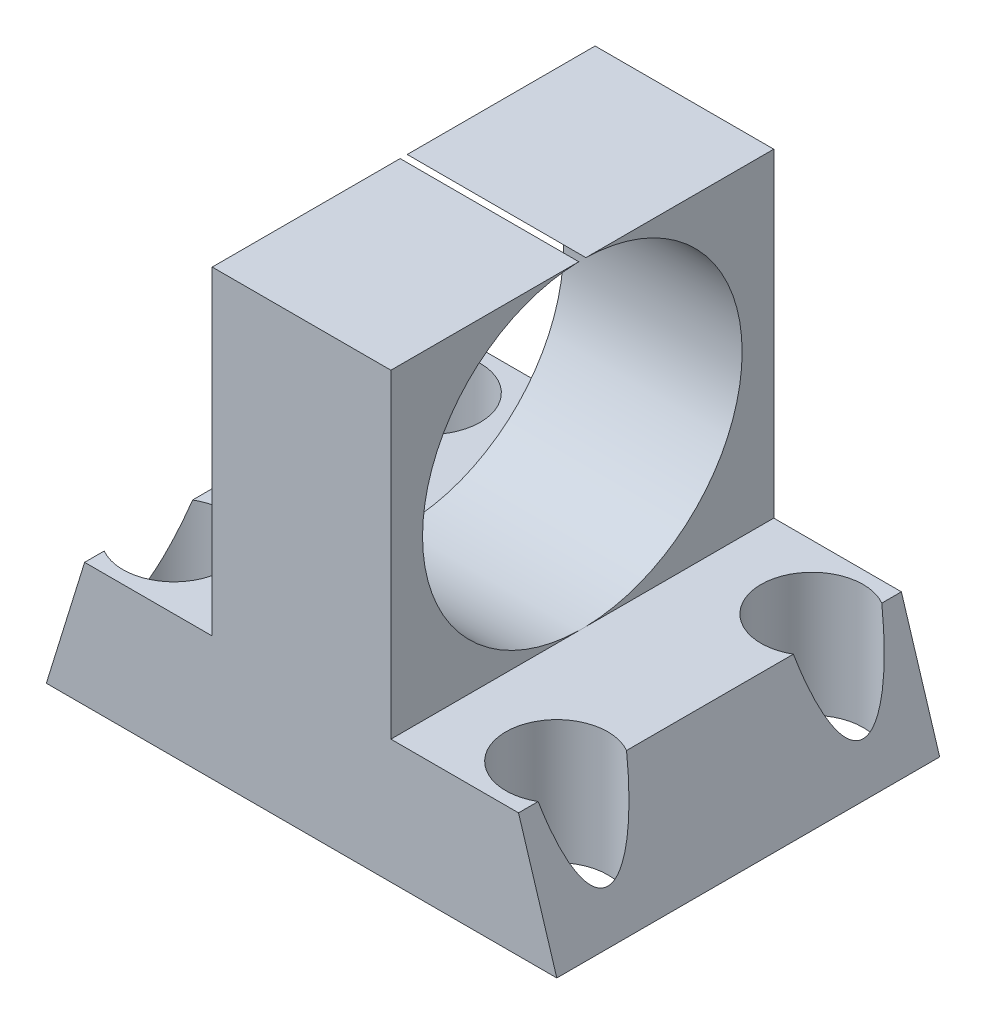
ISO-10303-21;
HEADER;
FILE_DESCRIPTION(('STEP AP214'),'2;1');
FILE_NAME('part.step','',(''),(''),'','','');
FILE_SCHEMA(('AUTOMOTIVE_DESIGN { 1 0 10303 214 1 1 1 1 }'));
ENDSEC;
DATA;
#1=APPLICATION_CONTEXT('core data for automotive mechanical design processes');
#2=APPLICATION_PROTOCOL_DEFINITION('international standard','automotive_design',2000,#1);
#3=PRODUCT_CONTEXT('',#1,'mechanical');
#4=PRODUCT('Part','Part','',(#3));
#5=PRODUCT_RELATED_PRODUCT_CATEGORY('part','',(#4));
#6=PRODUCT_DEFINITION_FORMATION('','',#4);
#7=PRODUCT_DEFINITION_CONTEXT('part definition',#1,'design');
#8=PRODUCT_DEFINITION('design','',#6,#7);
#9=PRODUCT_DEFINITION_SHAPE('','',#8);
#10=(LENGTH_UNIT() NAMED_UNIT(*) SI_UNIT(.MILLI.,.METRE.));
#11=(NAMED_UNIT(*) PLANE_ANGLE_UNIT() SI_UNIT($,.RADIAN.));
#12=(NAMED_UNIT(*) SI_UNIT($,.STERADIAN.) SOLID_ANGLE_UNIT());
#13=UNCERTAINTY_MEASURE_WITH_UNIT(LENGTH_MEASURE(1.E-05),#10,'distance_accuracy_value','');
#14=(GEOMETRIC_REPRESENTATION_CONTEXT(3) GLOBAL_UNCERTAINTY_ASSIGNED_CONTEXT((#13)) GLOBAL_UNIT_ASSIGNED_CONTEXT((#10,
#11,#12)) REPRESENTATION_CONTEXT('',''));
#15=CARTESIAN_POINT('',(0.,0.,0.));
#16=DIRECTION('',(0.,0.,1.));
#17=DIRECTION('',(1.,0.,0.));
#18=AXIS2_PLACEMENT_3D('',#15,#16,#17);
#19=CARTESIAN_POINT('',(-8.86861313868613,0.,15.));
#20=DIRECTION('',(0.955421064212183,-0.295246659692638,0.));
#21=DIRECTION('',(0.295246659692638,0.955421064212183,0.));
#22=AXIS2_PLACEMENT_3D('',#19,#20,#21);
#23=PLANE('',#22);
#24=CARTESIAN_POINT('',(-7.86861313868613,3.23600973236007,2.5));
#25=DIRECTION('',(0.955421064212183,-0.295246659692638,0.));
#26=DIRECTION('',(-0.295246659692638,-0.955421064212183,0.));
#27=AXIS2_PLACEMENT_3D('',#24,#25,#26);
#28=ELLIPSE('',#27,6.77399704397019,2.);
#29=CARTESIAN_POINT('',(-8.86861313868613,0.,0.767949192431118));
#30=VERTEX_POINT('',#29);
#31=CARTESIAN_POINT('',(-8.86861313868613,0.,4.23205080756888));
#32=VERTEX_POINT('',#31);
#33=EDGE_CURVE('E299',#30,#32,#28,.F.);
#34=ORIENTED_EDGE('',*,*,#33,.F.);
#35=DIRECTION('',(0.,0.,-1.));
#36=VECTOR('',#35,1.);
#37=CARTESIAN_POINT('',(-8.86861313868613,0.,15.));
#38=LINE('',#37,#36);
#39=CARTESIAN_POINT('',(-8.86861313868613,0.,0.));
#40=VERTEX_POINT('',#39);
#41=EDGE_CURVE('E41',#30,#40,#38,.T.);
#42=ORIENTED_EDGE('',*,*,#41,.T.);
#43=DIRECTION('',(-0.295246659692638,-0.955421064212183,0.));
#44=VECTOR('',#43,1.);
#45=CARTESIAN_POINT('',(-8.86861313868613,0.,0.));
#46=LINE('',#45,#44);
#47=CARTESIAN_POINT('',(-10.3686131386861,-4.85401459854015,0.));
#48=VERTEX_POINT('',#47);
#49=EDGE_CURVE('E350',#40,#48,#46,.T.);
#50=ORIENTED_EDGE('',*,*,#49,.T.);
#51=DIRECTION('',(0.,0.,-1.));
#52=VECTOR('',#51,1.);
#53=CARTESIAN_POINT('',(-10.3686131386861,-4.85401459854015,15.));
#54=LINE('',#53,#52);
#55=CARTESIAN_POINT('',(-10.3686131386861,-4.85401459854015,15.));
#56=VERTEX_POINT('',#55);
#57=EDGE_CURVE('E262',#56,#48,#54,.T.);
#58=ORIENTED_EDGE('',*,*,#57,.F.);
#59=DIRECTION('',(-0.295246659692638,-0.955421064212183,0.));
#60=VECTOR('',#59,1.);
#61=CARTESIAN_POINT('',(-8.86861313868613,0.,15.));
#62=LINE('',#61,#60);
#63=CARTESIAN_POINT('',(-8.86861313868613,0.,15.));
#64=VERTEX_POINT('',#63);
#65=EDGE_CURVE('E213',#64,#56,#62,.T.);
#66=ORIENTED_EDGE('',*,*,#65,.F.);
#67=CARTESIAN_POINT('',(-8.86861313868613,0.,14.2320508075689));
#68=VERTEX_POINT('',#67);
#69=EDGE_CURVE('E171',#64,#68,#38,.T.);
#70=ORIENTED_EDGE('',*,*,#69,.T.);
#71=CARTESIAN_POINT('',(-7.86861313868613,3.23600973236007,12.5));
#72=DIRECTION('',(0.955421064212183,-0.295246659692638,0.));
#73=DIRECTION('',(-0.295246659692638,-0.955421064212183,0.));
#74=AXIS2_PLACEMENT_3D('',#71,#72,#73);
#75=ELLIPSE('',#74,6.7739970439702,2.);
#76=CARTESIAN_POINT('',(-8.86861313868613,0.,10.7679491924311));
#77=VERTEX_POINT('',#76);
#78=EDGE_CURVE('E159',#68,#77,#75,.T.);
#79=ORIENTED_EDGE('',*,*,#78,.T.);
#80=CARTESIAN_POINT('',(-8.86861313868613,0.,7.63905587694962));
#81=VERTEX_POINT('',#80);
#82=EDGE_CURVE('E168',#77,#81,#38,.T.);
#83=ORIENTED_EDGE('',*,*,#82,.T.);
#84=CARTESIAN_POINT('',(-8.86861313868613,0.,7.63905587694962));
#85=CARTESIAN_POINT('',(-8.86956781317178,-0.00308933592682558,7.5));
#86=CARTESIAN_POINT('',(-8.86861313868613,0.,7.36094412305038));
#87=B_SPLINE_CURVE_WITH_KNOTS('',2,(#84,#85,#86),.UNSPECIFIED.,.F.,.F.,(3,3),(0.,1.),.UNSPECIFIED.);
#88=CARTESIAN_POINT('',(-8.86861313868613,0.,7.36094412305025));
#89=VERTEX_POINT('',#88);
#90=EDGE_CURVE('E208',#81,#89,#87,.T.);
#91=ORIENTED_EDGE('',*,*,#90,.T.);
#92=EDGE_CURVE('E179',#89,#32,#38,.T.);
#93=ORIENTED_EDGE('',*,*,#92,.T.);
#94=EDGE_LOOP('',(#34,#42,#50,#58,#66,#70,#79,#83,#91,#93));
#95=FACE_BOUND('',#94,.T.);
#96=ADVANCED_FACE('F37',(#95),#23,.F.);
#97=CARTESIAN_POINT('',(-10.3686131386861,-4.85401459854015,15.));
#98=DIRECTION('',(0.,1.,0.));
#99=DIRECTION('',(0.,0.,1.));
#100=AXIS2_PLACEMENT_3D('',#97,#98,#99);
#101=PLANE('',#100);
#102=CARTESIAN_POINT('',(7.13138686131387,-4.85401459854015,2.5));
#103=DIRECTION('',(0.,-1.,0.));
#104=DIRECTION('',(0.,0.,-1.));
#105=AXIS2_PLACEMENT_3D('',#102,#103,#104);
#106=CIRCLE('',#105,2.);
#107=CARTESIAN_POINT('',(7.13138686131387,-4.85401459854015,0.499999999999999));
#108=VERTEX_POINT('',#107);
#109=EDGE_CURVE('E309',#108,#108,#106,.T.);
#110=ORIENTED_EDGE('',*,*,#109,.F.);
#111=EDGE_LOOP('',(#110));
#112=FACE_BOUND('',#111,.T.);
#113=CARTESIAN_POINT('',(-7.86861313868613,-4.85401459854015,12.5));
#114=DIRECTION('',(0.,-1.,0.));
#115=DIRECTION('',(0.,0.,-1.));
#116=AXIS2_PLACEMENT_3D('',#113,#114,#115);
#117=CIRCLE('',#116,2.);
#118=CARTESIAN_POINT('',(-7.86861313868613,-4.85401459854015,10.5));
#119=VERTEX_POINT('',#118);
#120=EDGE_CURVE('E173',#119,#119,#117,.T.);
#121=ORIENTED_EDGE('',*,*,#120,.F.);
#122=EDGE_LOOP('',(#121));
#123=FACE_BOUND('',#122,.T.);
#124=DIRECTION('',(1.,0.,0.));
#125=VECTOR('',#124,1.);
#126=CARTESIAN_POINT('',(-10.3686131386861,-4.85401459854015,0.));
#127=LINE('',#126,#125);
#128=CARTESIAN_POINT('',(9.63138686131387,-4.85401459854015,0.));
#129=VERTEX_POINT('',#128);
#130=EDGE_CURVE('E377',#48,#129,#127,.T.);
#131=ORIENTED_EDGE('',*,*,#130,.T.);
#132=DIRECTION('',(0.,0.,-1.));
#133=VECTOR('',#132,1.);
#134=CARTESIAN_POINT('',(9.63138686131387,-4.85401459854015,15.));
#135=LINE('',#134,#133);
#136=CARTESIAN_POINT('',(9.63138686131387,-4.85401459854015,15.));
#137=VERTEX_POINT('',#136);
#138=EDGE_CURVE('E337',#137,#129,#135,.T.);
#139=ORIENTED_EDGE('',*,*,#138,.F.);
#140=DIRECTION('',(1.,0.,0.));
#141=VECTOR('',#140,1.);
#142=CARTESIAN_POINT('',(-10.3686131386861,-4.85401459854015,15.));
#143=LINE('',#142,#141);
#144=EDGE_CURVE('E406',#56,#137,#143,.T.);
#145=ORIENTED_EDGE('',*,*,#144,.F.);
#146=ORIENTED_EDGE('',*,*,#57,.T.);
#147=EDGE_LOOP('',(#131,#139,#145,#146));
#148=FACE_BOUND('',#147,.T.);
#149=CARTESIAN_POINT('',(7.13138686131387,-4.85401459854015,12.5));
#150=DIRECTION('',(0.,-1.,0.));
#151=DIRECTION('',(0.,0.,-1.));
#152=AXIS2_PLACEMENT_3D('',#149,#150,#151);
#153=CIRCLE('',#152,2.);
#154=CARTESIAN_POINT('',(7.13138686131387,-4.85401459854015,10.5));
#155=VERTEX_POINT('',#154);
#156=EDGE_CURVE('E305',#155,#155,#153,.F.);
#157=ORIENTED_EDGE('',*,*,#156,.T.);
#158=EDGE_LOOP('',(#157));
#159=FACE_BOUND('',#158,.T.);
#160=CARTESIAN_POINT('',(-7.86861313868613,-4.85401459854015,2.5));
#161=DIRECTION('',(0.,-1.,0.));
#162=DIRECTION('',(0.,0.,-1.));
#163=AXIS2_PLACEMENT_3D('',#160,#161,#162);
#164=CIRCLE('',#163,2.);
#165=CARTESIAN_POINT('',(-7.86861313868613,-4.85401459854015,0.499999999999998));
#166=VERTEX_POINT('',#165);
#167=EDGE_CURVE('E306',#166,#166,#164,.F.);
#168=ORIENTED_EDGE('',*,*,#167,.T.);
#169=EDGE_LOOP('',(#168));
#170=FACE_BOUND('',#169,.T.);
#171=ADVANCED_FACE('F315',(#112,#123,#148,#159,#170),#101,.F.);
#172=CARTESIAN_POINT('',(9.63138686131387,-4.85401459854015,15.));
#173=DIRECTION('',(-0.955421064212183,-0.295246659692637,0.));
#174=DIRECTION('',(0.295246659692637,-0.955421064212183,0.));
#175=AXIS2_PLACEMENT_3D('',#172,#173,#174);
#176=PLANE('',#175);
#177=DIRECTION('',(0.,0.,-1.));
#178=VECTOR('',#177,1.);
#179=CARTESIAN_POINT('',(8.13138686131387,0.,15.));
#180=LINE('',#179,#178);
#181=CARTESIAN_POINT('',(8.13138686131387,0.,0.76794919243112));
#182=VERTEX_POINT('',#181);
#183=CARTESIAN_POINT('',(8.13138686131387,0.,0.));
#184=VERTEX_POINT('',#183);
#185=EDGE_CURVE('E336',#182,#184,#180,.T.);
#186=ORIENTED_EDGE('',*,*,#185,.F.);
#187=CARTESIAN_POINT('',(7.13138686131387,3.23600973236008,2.5));
#188=DIRECTION('',(-0.955421064212183,-0.295246659692637,0.));
#189=DIRECTION('',(0.295246659692637,-0.955421064212183,0.));
#190=AXIS2_PLACEMENT_3D('',#187,#188,#189);
#191=ELLIPSE('',#190,6.7739970439702,2.);
#192=CARTESIAN_POINT('',(8.13138686131387,0.,4.23205080756888));
#193=VERTEX_POINT('',#192);
#194=EDGE_CURVE('E60',#182,#193,#191,.T.);
#195=ORIENTED_EDGE('',*,*,#194,.T.);
#196=CARTESIAN_POINT('',(8.13138686131387,0.,10.7679491924311));
#197=VERTEX_POINT('',#196);
#198=EDGE_CURVE('E332',#197,#193,#180,.T.);
#199=ORIENTED_EDGE('',*,*,#198,.F.);
#200=CARTESIAN_POINT('',(7.13138686131387,3.23600973236008,12.5));
#201=DIRECTION('',(-0.955421064212183,-0.295246659692637,0.));
#202=DIRECTION('',(0.295246659692637,-0.955421064212183,0.));
#203=AXIS2_PLACEMENT_3D('',#200,#201,#202);
#204=ELLIPSE('',#203,6.7739970439702,2.);
#205=CARTESIAN_POINT('',(8.13138686131387,0.,14.2320508075689));
#206=VERTEX_POINT('',#205);
#207=EDGE_CURVE('E172',#206,#197,#204,.F.);
#208=ORIENTED_EDGE('',*,*,#207,.F.);
#209=CARTESIAN_POINT('',(8.13138686131387,0.,15.));
#210=VERTEX_POINT('',#209);
#211=EDGE_CURVE('E279',#210,#206,#180,.T.);
#212=ORIENTED_EDGE('',*,*,#211,.F.);
#213=DIRECTION('',(-0.295246659692637,0.955421064212183,0.));
#214=VECTOR('',#213,1.);
#215=CARTESIAN_POINT('',(9.63138686131387,-4.85401459854015,15.));
#216=LINE('',#215,#214);
#217=EDGE_CURVE('E388',#137,#210,#216,.T.);
#218=ORIENTED_EDGE('',*,*,#217,.F.);
#219=ORIENTED_EDGE('',*,*,#138,.T.);
#220=DIRECTION('',(-0.295246659692637,0.955421064212183,0.));
#221=VECTOR('',#220,1.);
#222=CARTESIAN_POINT('',(9.63138686131387,-4.85401459854015,0.));
#223=LINE('',#222,#221);
#224=EDGE_CURVE('E385',#129,#184,#223,.T.);
#225=ORIENTED_EDGE('',*,*,#224,.T.);
#226=EDGE_LOOP('',(#186,#195,#199,#208,#212,#218,#219,#225));
#227=FACE_BOUND('',#226,.T.);
#228=ADVANCED_FACE('F335',(#227),#176,.F.);
#229=CARTESIAN_POINT('',(8.13138686131387,0.,15.));
#230=DIRECTION('',(0.,-1.,0.));
#231=DIRECTION('',(1.,0.,0.));
#232=AXIS2_PLACEMENT_3D('',#229,#230,#231);
#233=PLANE('',#232);
#234=ORIENTED_EDGE('',*,*,#198,.T.);
#235=CARTESIAN_POINT('',(7.13138686131387,0.,2.5));
#236=DIRECTION('',(0.,-1.,0.));
#237=DIRECTION('',(1.,0.,0.));
#238=AXIS2_PLACEMENT_3D('',#235,#236,#237);
#239=CIRCLE('',#238,2.);
#240=EDGE_CURVE('E11',#193,#182,#239,.T.);
#241=ORIENTED_EDGE('',*,*,#240,.T.);
#242=ORIENTED_EDGE('',*,*,#185,.T.);
#243=DIRECTION('',(-1.,0.,0.));
#244=VECTOR('',#243,1.);
#245=CARTESIAN_POINT('',(8.13138686131387,0.,0.));
#246=LINE('',#245,#244);
#247=CARTESIAN_POINT('',(3.13138686131387,0.,0.));
#248=VERTEX_POINT('',#247);
#249=EDGE_CURVE('E390',#184,#248,#246,.T.);
#250=ORIENTED_EDGE('',*,*,#249,.T.);
#251=DIRECTION('',(0.,0.,-1.));
#252=VECTOR('',#251,1.);
#253=CARTESIAN_POINT('',(3.13138686131387,0.,15.));
#254=LINE('',#253,#252);
#255=CARTESIAN_POINT('',(3.13138686131387,0.,7.36094412305018));
#256=VERTEX_POINT('',#255);
#257=EDGE_CURVE('E270',#256,#248,#254,.T.);
#258=ORIENTED_EDGE('',*,*,#257,.F.);
#259=CARTESIAN_POINT('',(3.13138686131387,6.25912408759124,7.5));
#260=DIRECTION('',(1.,0.,0.));
#261=DIRECTION('',(0.,-0.999753304716146,0.022211026746761));
#262=AXIS2_PLACEMENT_3D('',#259,#260,#261);
#263=CIRCLE('',#262,6.260668565);
#264=CARTESIAN_POINT('',(3.13138686131387,0.,7.63905587694982));
#265=VERTEX_POINT('',#264);
#266=EDGE_CURVE('E240',#265,#256,#263,.T.);
#267=ORIENTED_EDGE('',*,*,#266,.F.);
#268=CARTESIAN_POINT('',(3.13138686131387,0.,15.));
#269=VERTEX_POINT('',#268);
#270=EDGE_CURVE('E282',#269,#265,#254,.T.);
#271=ORIENTED_EDGE('',*,*,#270,.F.);
#272=DIRECTION('',(-1.,0.,0.));
#273=VECTOR('',#272,1.);
#274=CARTESIAN_POINT('',(8.13138686131387,0.,15.));
#275=LINE('',#274,#273);
#276=EDGE_CURVE('E348',#210,#269,#275,.T.);
#277=ORIENTED_EDGE('',*,*,#276,.F.);
#278=ORIENTED_EDGE('',*,*,#211,.T.);
#279=CARTESIAN_POINT('',(7.13138686131387,0.,12.5));
#280=DIRECTION('',(0.,-1.,0.));
#281=DIRECTION('',(1.,0.,0.));
#282=AXIS2_PLACEMENT_3D('',#279,#280,#281);
#283=CIRCLE('',#282,2.);
#284=EDGE_CURVE('E47',#197,#206,#283,.F.);
#285=ORIENTED_EDGE('',*,*,#284,.F.);
#286=EDGE_LOOP('',(#234,#241,#242,#250,#258,#267,#271,#277,#278,#285));
#287=FACE_BOUND('',#286,.T.);
#288=ADVANCED_FACE('F331',(#287),#233,.F.);
#289=CARTESIAN_POINT('',(3.13138686131387,0.,15.));
#290=DIRECTION('',(-1.,0.,0.));
#291=DIRECTION('',(0.,-1.,0.));
#292=AXIS2_PLACEMENT_3D('',#289,#290,#291);
#293=PLANE('',#292);
#294=ORIENTED_EDGE('',*,*,#270,.T.);
#295=CARTESIAN_POINT('',(3.13138686131387,6.25912408759124,7.5));
#296=DIRECTION('',(1.,0.,0.));
#297=DIRECTION('',(0.,1.,0.));
#298=AXIS2_PLACEMENT_3D('',#295,#296,#297);
#299=CIRCLE('',#298,6.260668565);
#300=CARTESIAN_POINT('',(3.13138686131387,12.5182481751825,7.63905587694975));
#301=VERTEX_POINT('',#300);
#302=EDGE_CURVE('E242',#301,#265,#299,.T.);
#303=ORIENTED_EDGE('',*,*,#302,.F.);
#304=DIRECTION('',(0.,0.,-1.));
#305=VECTOR('',#304,1.);
#306=CARTESIAN_POINT('',(3.13138686131387,12.5182481751825,15.));
#307=LINE('',#306,#305);
#308=CARTESIAN_POINT('',(3.13138686131387,12.5182481751825,15.));
#309=VERTEX_POINT('',#308);
#310=EDGE_CURVE('E266',#309,#301,#307,.T.);
#311=ORIENTED_EDGE('',*,*,#310,.F.);
#312=DIRECTION('',(0.,1.,0.));
#313=VECTOR('',#312,1.);
#314=CARTESIAN_POINT('',(3.13138686131387,0.,15.));
#315=LINE('',#314,#313);
#316=EDGE_CURVE('E347',#269,#309,#315,.T.);
#317=ORIENTED_EDGE('',*,*,#316,.F.);
#318=EDGE_LOOP('',(#294,#303,#311,#317));
#319=FACE_BOUND('',#318,.T.);
#320=ADVANCED_FACE('F345',(#319),#293,.F.);
#321=CARTESIAN_POINT('',(3.13138686131387,12.5182481751825,15.));
#322=DIRECTION('',(0.,-1.,0.));
#323=DIRECTION('',(0.,0.,-1.));
#324=AXIS2_PLACEMENT_3D('',#321,#322,#323);
#325=PLANE('',#324);
#326=DIRECTION('',(0.,0.,-1.));
#327=VECTOR('',#326,1.);
#328=CARTESIAN_POINT('',(-3.86861313868613,12.5182481751825,15.));
#329=LINE('',#328,#327);
#330=CARTESIAN_POINT('',(-3.86861313868613,12.5182481751825,7.3609441230502));
#331=VERTEX_POINT('',#330);
#332=CARTESIAN_POINT('',(-3.86861313868613,12.5182481751825,0.));
#333=VERTEX_POINT('',#332);
#334=EDGE_CURVE('E421',#331,#333,#329,.T.);
#335=ORIENTED_EDGE('',*,*,#334,.F.);
#336=DIRECTION('',(1.,0.,0.));
#337=VECTOR('',#336,1.);
#338=CARTESIAN_POINT('',(-16.8686131386861,12.5182481751825,7.36094412305013));
#339=LINE('',#338,#337);
#340=CARTESIAN_POINT('',(3.13138686131387,12.5182481751825,7.36094412305025));
#341=VERTEX_POINT('',#340);
#342=EDGE_CURVE('E256',#331,#341,#339,.T.);
#343=ORIENTED_EDGE('',*,*,#342,.T.);
#344=CARTESIAN_POINT('',(3.13138686131387,12.5182481751825,0.));
#345=VERTEX_POINT('',#344);
#346=EDGE_CURVE('E271',#341,#345,#307,.T.);
#347=ORIENTED_EDGE('',*,*,#346,.T.);
#348=DIRECTION('',(-1.,0.,0.));
#349=VECTOR('',#348,1.);
#350=CARTESIAN_POINT('',(3.13138686131387,12.5182481751825,0.));
#351=LINE('',#350,#349);
#352=EDGE_CURVE('E398',#345,#333,#351,.T.);
#353=ORIENTED_EDGE('',*,*,#352,.T.);
#354=EDGE_LOOP('',(#335,#343,#347,#353));
#355=FACE_BOUND('',#354,.T.);
#356=ADVANCED_FACE('F420',(#355),#325,.F.);
#357=CARTESIAN_POINT('',(-3.86861313868613,12.5182481751825,15.));
#358=DIRECTION('',(1.,0.,0.));
#359=DIRECTION('',(0.,0.,-1.));
#360=AXIS2_PLACEMENT_3D('',#357,#358,#359);
#361=PLANE('',#360);
#362=CARTESIAN_POINT('',(-3.86861313868613,12.5182481751825,15.));
#363=VERTEX_POINT('',#362);
#364=CARTESIAN_POINT('',(-3.86861313868613,12.5182481751825,7.6390558769498));
#365=VERTEX_POINT('',#364);
#366=EDGE_CURVE('E275',#363,#365,#329,.T.);
#367=ORIENTED_EDGE('',*,*,#366,.T.);
#368=CARTESIAN_POINT('',(-3.86861313868613,6.25912408759124,7.5));
#369=DIRECTION('',(1.,0.,0.));
#370=DIRECTION('',(0.,0.,-1.));
#371=AXIS2_PLACEMENT_3D('',#368,#369,#370);
#372=CIRCLE('',#371,6.260668565);
#373=CARTESIAN_POINT('',(-3.86861313868613,0.,7.63905587694962));
#374=VERTEX_POINT('',#373);
#375=EDGE_CURVE('E245',#365,#374,#372,.T.);
#376=ORIENTED_EDGE('',*,*,#375,.T.);
#377=DIRECTION('',(0.,0.,-1.));
#378=VECTOR('',#377,1.);
#379=CARTESIAN_POINT('',(-3.86861313868613,0.,15.));
#380=LINE('',#379,#378);
#381=CARTESIAN_POINT('',(-3.86861313868613,0.,15.));
#382=VERTEX_POINT('',#381);
#383=EDGE_CURVE('E192',#382,#374,#380,.T.);
#384=ORIENTED_EDGE('',*,*,#383,.F.);
#385=DIRECTION('',(0.,-1.,0.));
#386=VECTOR('',#385,1.);
#387=CARTESIAN_POINT('',(-3.86861313868613,12.5182481751825,15.));
#388=LINE('',#387,#386);
#389=EDGE_CURVE('E414',#363,#382,#388,.T.);
#390=ORIENTED_EDGE('',*,*,#389,.F.);
#391=EDGE_LOOP('',(#367,#376,#384,#390));
#392=FACE_BOUND('',#391,.T.);
#393=ADVANCED_FACE('F436',(#392),#361,.F.);
#394=CARTESIAN_POINT('',(-3.86861313868613,0.,15.));
#395=DIRECTION('',(0.,-1.,0.));
#396=DIRECTION('',(1.,0.,0.));
#397=AXIS2_PLACEMENT_3D('',#394,#395,#396);
#398=PLANE('',#397);
#399=CARTESIAN_POINT('',(-7.86861313868613,0.,2.5));
#400=DIRECTION('',(0.,-1.,0.));
#401=DIRECTION('',(1.,0.,0.));
#402=AXIS2_PLACEMENT_3D('',#399,#400,#401);
#403=CIRCLE('',#402,2.);
#404=EDGE_CURVE('E53',#32,#30,#403,.F.);
#405=ORIENTED_EDGE('',*,*,#404,.F.);
#406=ORIENTED_EDGE('',*,*,#92,.F.);
#407=DIRECTION('',(1.,0.,0.));
#408=VECTOR('',#407,1.);
#409=CARTESIAN_POINT('',(-16.8686131386861,0.,7.36094412305038));
#410=LINE('',#409,#408);
#411=CARTESIAN_POINT('',(-3.86861313868613,0.,7.36094412305038));
#412=VERTEX_POINT('',#411);
#413=EDGE_CURVE('E164',#89,#412,#410,.T.);
#414=ORIENTED_EDGE('',*,*,#413,.T.);
#415=CARTESIAN_POINT('',(-3.86861313868613,0.,0.));
#416=VERTEX_POINT('',#415);
#417=EDGE_CURVE('E181',#412,#416,#380,.T.);
#418=ORIENTED_EDGE('',*,*,#417,.T.);
#419=DIRECTION('',(-1.,0.,0.));
#420=VECTOR('',#419,1.);
#421=CARTESIAN_POINT('',(-3.86861313868613,0.,0.));
#422=LINE('',#421,#420);
#423=EDGE_CURVE('E190',#416,#40,#422,.T.);
#424=ORIENTED_EDGE('',*,*,#423,.T.);
#425=ORIENTED_EDGE('',*,*,#41,.F.);
#426=EDGE_LOOP('',(#405,#406,#414,#418,#424,#425));
#427=FACE_BOUND('',#426,.T.);
#428=ADVANCED_FACE('F295',(#427),#398,.F.);
#429=ORIENTED_EDGE('',*,*,#346,.F.);
#430=EDGE_CURVE('E246',#256,#341,#299,.T.);
#431=ORIENTED_EDGE('',*,*,#430,.F.);
#432=ORIENTED_EDGE('',*,*,#257,.T.);
#433=DIRECTION('',(0.,1.,0.));
#434=VECTOR('',#433,1.);
#435=CARTESIAN_POINT('',(3.13138686131387,0.,0.));
#436=LINE('',#435,#434);
#437=EDGE_CURVE('E392',#248,#345,#436,.T.);
#438=ORIENTED_EDGE('',*,*,#437,.T.);
#439=EDGE_LOOP('',(#429,#431,#432,#438));
#440=FACE_BOUND('',#439,.T.);
#441=ADVANCED_FACE('F363',(#440),#293,.F.);
#442=ORIENTED_EDGE('',*,*,#310,.T.);
#443=DIRECTION('',(1.,0.,0.));
#444=VECTOR('',#443,1.);
#445=CARTESIAN_POINT('',(-16.8686131386861,12.5182481751825,7.63905587694987));
#446=LINE('',#445,#444);
#447=EDGE_CURVE('E247',#301,#365,#446,.F.);
#448=ORIENTED_EDGE('',*,*,#447,.T.);
#449=ORIENTED_EDGE('',*,*,#366,.F.);
#450=DIRECTION('',(-1.,0.,0.));
#451=VECTOR('',#450,1.);
#452=CARTESIAN_POINT('',(3.13138686131387,12.5182481751825,15.));
#453=LINE('',#452,#451);
#454=EDGE_CURVE('E412',#309,#363,#453,.T.);
#455=ORIENTED_EDGE('',*,*,#454,.F.);
#456=EDGE_LOOP('',(#442,#448,#449,#455));
#457=FACE_BOUND('',#456,.T.);
#458=ADVANCED_FACE('F433',(#457),#325,.F.);
#459=ORIENTED_EDGE('',*,*,#417,.F.);
#460=EDGE_CURVE('E259',#412,#331,#372,.T.);
#461=ORIENTED_EDGE('',*,*,#460,.T.);
#462=ORIENTED_EDGE('',*,*,#334,.T.);
#463=DIRECTION('',(0.,-1.,0.));
#464=VECTOR('',#463,1.);
#465=CARTESIAN_POINT('',(-3.86861313868613,12.5182481751825,0.));
#466=LINE('',#465,#464);
#467=EDGE_CURVE('E400',#333,#416,#466,.T.);
#468=ORIENTED_EDGE('',*,*,#467,.T.);
#469=EDGE_LOOP('',(#459,#461,#462,#468));
#470=FACE_BOUND('',#469,.T.);
#471=ADVANCED_FACE('F425',(#470),#361,.F.);
#472=ORIENTED_EDGE('',*,*,#82,.F.);
#473=CARTESIAN_POINT('',(-7.86861313868613,0.,12.5));
#474=DIRECTION('',(0.,-1.,0.));
#475=DIRECTION('',(1.,0.,0.));
#476=AXIS2_PLACEMENT_3D('',#473,#474,#475);
#477=CIRCLE('',#476,2.);
#478=EDGE_CURVE('E156',#77,#68,#477,.T.);
#479=ORIENTED_EDGE('',*,*,#478,.T.);
#480=ORIENTED_EDGE('',*,*,#69,.F.);
#481=DIRECTION('',(-1.,0.,0.));
#482=VECTOR('',#481,1.);
#483=CARTESIAN_POINT('',(-3.86861313868613,0.,15.));
#484=LINE('',#483,#482);
#485=EDGE_CURVE('E416',#382,#64,#484,.T.);
#486=ORIENTED_EDGE('',*,*,#485,.F.);
#487=ORIENTED_EDGE('',*,*,#383,.T.);
#488=DIRECTION('',(1.,0.,0.));
#489=VECTOR('',#488,1.);
#490=CARTESIAN_POINT('',(-16.8686131386861,0.,7.63905587694962));
#491=LINE('',#490,#489);
#492=EDGE_CURVE('E178',#374,#81,#491,.F.);
#493=ORIENTED_EDGE('',*,*,#492,.T.);
#494=EDGE_LOOP('',(#472,#479,#480,#486,#487,#493));
#495=FACE_BOUND('',#494,.T.);
#496=ADVANCED_FACE('F176',(#495),#398,.F.);
#497=CARTESIAN_POINT('',(0.,0.,15.));
#498=DIRECTION('',(0.,0.,1.));
#499=DIRECTION('',(1.,0.,0.));
#500=AXIS2_PLACEMENT_3D('',#497,#498,#499);
#501=PLANE('',#500);
#502=ORIENTED_EDGE('',*,*,#65,.T.);
#503=ORIENTED_EDGE('',*,*,#144,.T.);
#504=ORIENTED_EDGE('',*,*,#217,.T.);
#505=ORIENTED_EDGE('',*,*,#276,.T.);
#506=ORIENTED_EDGE('',*,*,#316,.T.);
#507=ORIENTED_EDGE('',*,*,#454,.T.);
#508=ORIENTED_EDGE('',*,*,#389,.T.);
#509=ORIENTED_EDGE('',*,*,#485,.T.);
#510=EDGE_LOOP('',(#502,#503,#504,#505,#506,#507,#508,#509));
#511=FACE_BOUND('',#510,.T.);
#512=ADVANCED_FACE('F227',(#511),#501,.T.);
#513=CARTESIAN_POINT('',(0.,0.,0.));
#514=DIRECTION('',(0.,0.,1.));
#515=DIRECTION('',(1.,0.,0.));
#516=AXIS2_PLACEMENT_3D('',#513,#514,#515);
#517=PLANE('',#516);
#518=ORIENTED_EDGE('',*,*,#49,.F.);
#519=ORIENTED_EDGE('',*,*,#423,.F.);
#520=ORIENTED_EDGE('',*,*,#467,.F.);
#521=ORIENTED_EDGE('',*,*,#352,.F.);
#522=ORIENTED_EDGE('',*,*,#437,.F.);
#523=ORIENTED_EDGE('',*,*,#249,.F.);
#524=ORIENTED_EDGE('',*,*,#224,.F.);
#525=ORIENTED_EDGE('',*,*,#130,.F.);
#526=EDGE_LOOP('',(#518,#519,#520,#521,#522,#523,#524,#525));
#527=FACE_BOUND('',#526,.T.);
#528=ADVANCED_FACE('F225',(#527),#517,.F.);
#529=CARTESIAN_POINT('',(-16.8686131386861,6.25912408759124,7.5));
#530=DIRECTION('',(1.,0.,0.));
#531=DIRECTION('',(0.,1.,0.));
#532=AXIS2_PLACEMENT_3D('',#529,#530,#531);
#533=CYLINDRICAL_SURFACE('',#532,6.260668565);
#534=ORIENTED_EDGE('',*,*,#460,.F.);
#535=ORIENTED_EDGE('',*,*,#413,.F.);
#536=ORIENTED_EDGE('',*,*,#90,.F.);
#537=ORIENTED_EDGE('',*,*,#492,.F.);
#538=ORIENTED_EDGE('',*,*,#375,.F.);
#539=ORIENTED_EDGE('',*,*,#447,.F.);
#540=ORIENTED_EDGE('',*,*,#302,.T.);
#541=ORIENTED_EDGE('',*,*,#266,.T.);
#542=ORIENTED_EDGE('',*,*,#430,.T.);
#543=ORIENTED_EDGE('',*,*,#342,.F.);
#544=EDGE_LOOP('',(#534,#535,#536,#537,#538,#539,#540,#541,#542,#543));
#545=FACE_BOUND('',#544,.T.);
#546=ADVANCED_FACE('F215',(#545),#533,.F.);
#547=CARTESIAN_POINT('',(-7.86861313868613,15.1459854014599,12.5));
#548=DIRECTION('',(0.,-1.,0.));
#549=DIRECTION('',(0.,0.,-1.));
#550=AXIS2_PLACEMENT_3D('',#547,#548,#549);
#551=CYLINDRICAL_SURFACE('',#550,2.);
#552=ORIENTED_EDGE('',*,*,#120,.T.);
#553=EDGE_LOOP('',(#552));
#554=FACE_BOUND('',#553,.T.);
#555=ORIENTED_EDGE('',*,*,#478,.F.);
#556=ORIENTED_EDGE('',*,*,#78,.F.);
#557=EDGE_LOOP('',(#555,#556));
#558=FACE_BOUND('',#557,.T.);
#559=ADVANCED_FACE('F158',(#554,#558),#551,.F.);
#560=CARTESIAN_POINT('',(7.13138686131387,15.1459854014599,12.5));
#561=DIRECTION('',(0.,-1.,0.));
#562=DIRECTION('',(0.,0.,-1.));
#563=AXIS2_PLACEMENT_3D('',#560,#561,#562);
#564=CYLINDRICAL_SURFACE('',#563,2.);
#565=ORIENTED_EDGE('',*,*,#156,.F.);
#566=EDGE_LOOP('',(#565));
#567=FACE_BOUND('',#566,.T.);
#568=ORIENTED_EDGE('',*,*,#207,.T.);
#569=ORIENTED_EDGE('',*,*,#284,.T.);
#570=EDGE_LOOP('',(#568,#569));
#571=FACE_BOUND('',#570,.T.);
#572=ADVANCED_FACE('F318',(#567,#571),#564,.F.);
#573=CARTESIAN_POINT('',(7.13138686131387,15.1459854014599,2.5));
#574=DIRECTION('',(0.,-1.,0.));
#575=DIRECTION('',(0.,0.,-1.));
#576=AXIS2_PLACEMENT_3D('',#573,#574,#575);
#577=CYLINDRICAL_SURFACE('',#576,2.);
#578=ORIENTED_EDGE('',*,*,#109,.T.);
#579=EDGE_LOOP('',(#578));
#580=FACE_BOUND('',#579,.T.);
#581=ORIENTED_EDGE('',*,*,#240,.F.);
#582=ORIENTED_EDGE('',*,*,#194,.F.);
#583=EDGE_LOOP('',(#581,#582));
#584=FACE_BOUND('',#583,.T.);
#585=ADVANCED_FACE('F321',(#580,#584),#577,.F.);
#586=CARTESIAN_POINT('',(-7.86861313868613,15.1459854014599,2.5));
#587=DIRECTION('',(0.,-1.,0.));
#588=DIRECTION('',(0.,0.,-1.));
#589=AXIS2_PLACEMENT_3D('',#586,#587,#588);
#590=CYLINDRICAL_SURFACE('',#589,2.);
#591=ORIENTED_EDGE('',*,*,#167,.F.);
#592=EDGE_LOOP('',(#591));
#593=FACE_BOUND('',#592,.T.);
#594=ORIENTED_EDGE('',*,*,#404,.T.);
#595=ORIENTED_EDGE('',*,*,#33,.T.);
#596=EDGE_LOOP('',(#594,#595));
#597=FACE_BOUND('',#596,.T.);
#598=ADVANCED_FACE('F529',(#593,#597),#590,.F.);
#599=CLOSED_SHELL('',(#96,#171,#228,#288,#320,#356,#393,#428,#441,#458,#471,#496,#512,#528,#546,
#559,#572,#585,#598));
#600=MANIFOLD_SOLID_BREP('B2',#599);
#601=ADVANCED_BREP_SHAPE_REPRESENTATION('',(#18,#600),#14);
#602=SHAPE_DEFINITION_REPRESENTATION(#9,#601);
ENDSEC;
END-ISO-10303-21;
